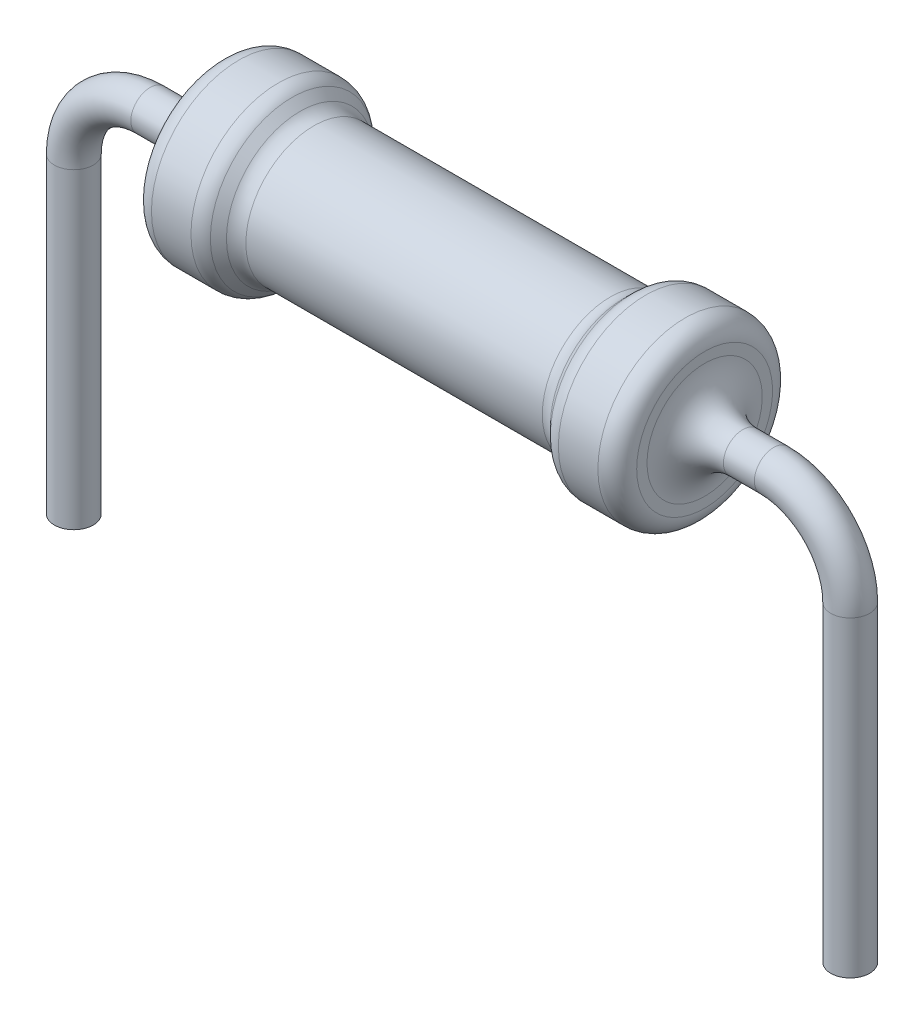
ISO-10303-21;
HEADER;
FILE_DESCRIPTION(('STEP AP214'),'2;1');
FILE_NAME('part.step','',(''),(''),'','','');
FILE_SCHEMA(('AUTOMOTIVE_DESIGN { 1 0 10303 214 1 1 1 1 }'));
ENDSEC;
DATA;
#1=APPLICATION_CONTEXT('core data for automotive mechanical design processes');
#2=APPLICATION_PROTOCOL_DEFINITION('international standard','automotive_design',2000,#1);
#3=PRODUCT_CONTEXT('',#1,'mechanical');
#4=PRODUCT('Part','Part','',(#3));
#5=PRODUCT_RELATED_PRODUCT_CATEGORY('part','',(#4));
#6=PRODUCT_DEFINITION_FORMATION('','',#4);
#7=PRODUCT_DEFINITION_CONTEXT('part definition',#1,'design');
#8=PRODUCT_DEFINITION('design','',#6,#7);
#9=PRODUCT_DEFINITION_SHAPE('','',#8);
#10=(LENGTH_UNIT() NAMED_UNIT(*) SI_UNIT(.MILLI.,.METRE.));
#11=(NAMED_UNIT(*) PLANE_ANGLE_UNIT() SI_UNIT($,.RADIAN.));
#12=(NAMED_UNIT(*) SI_UNIT($,.STERADIAN.) SOLID_ANGLE_UNIT());
#13=UNCERTAINTY_MEASURE_WITH_UNIT(LENGTH_MEASURE(1.E-05),#10,'distance_accuracy_value','');
#14=(GEOMETRIC_REPRESENTATION_CONTEXT(3) GLOBAL_UNCERTAINTY_ASSIGNED_CONTEXT((#13)) GLOBAL_UNIT_ASSIGNED_CONTEXT((#10,
#11,#12)) REPRESENTATION_CONTEXT('',''));
#15=CARTESIAN_POINT('',(0.,0.,0.));
#16=DIRECTION('',(0.,0.,1.));
#17=DIRECTION('',(1.,0.,0.));
#18=AXIS2_PLACEMENT_3D('',#15,#16,#17);
#19=CARTESIAN_POINT('',(3.175,0.889,0.));
#20=DIRECTION('',(-1.,0.,0.));
#21=DIRECTION('',(0.,0.,1.));
#22=AXIS2_PLACEMENT_3D('',#19,#20,#21);
#23=PLANE('',#22);
#24=CARTESIAN_POINT('',(3.175,0.,0.));
#25=DIRECTION('',(-1.,0.,0.));
#26=DIRECTION('',(0.,0.,1.));
#27=AXIS2_PLACEMENT_3D('',#24,#25,#26);
#28=CIRCLE('',#27,0.754);
#29=CARTESIAN_POINT('',(3.175,0.,0.754));
#30=VERTEX_POINT('',#29);
#31=EDGE_CURVE('E42',#30,#30,#28,.T.);
#32=ORIENTED_EDGE('',*,*,#31,.T.);
#33=EDGE_LOOP('',(#32));
#34=FACE_BOUND('',#33,.T.);
#35=CARTESIAN_POINT('',(3.175,0.,0.));
#36=DIRECTION('',(-1.,0.,0.));
#37=DIRECTION('',(0.,0.,1.));
#38=AXIS2_PLACEMENT_3D('',#35,#36,#37);
#39=CIRCLE('',#38,0.889);
#40=CARTESIAN_POINT('',(3.175,0.,0.889));
#41=VERTEX_POINT('',#40);
#42=EDGE_CURVE('E84',#41,#41,#39,.T.);
#43=ORIENTED_EDGE('',*,*,#42,.F.);
#44=EDGE_LOOP('',(#43));
#45=FACE_BOUND('',#44,.T.);
#46=ADVANCED_FACE('F31',(#34,#45),#23,.F.);
#47=CARTESIAN_POINT('',(-3.175,0.889,0.));
#48=DIRECTION('',(1.,0.,0.));
#49=DIRECTION('',(0.,0.,-1.));
#50=AXIS2_PLACEMENT_3D('',#47,#48,#49);
#51=PLANE('',#50);
#52=CARTESIAN_POINT('',(-3.175,0.,0.));
#53=DIRECTION('',(1.,0.,0.));
#54=DIRECTION('',(0.,0.,-1.));
#55=AXIS2_PLACEMENT_3D('',#52,#53,#54);
#56=CIRCLE('',#55,0.754);
#57=CARTESIAN_POINT('',(-3.175,0.,-0.754));
#58=VERTEX_POINT('',#57);
#59=EDGE_CURVE('E38',#58,#58,#56,.T.);
#60=ORIENTED_EDGE('',*,*,#59,.T.);
#61=EDGE_LOOP('',(#60));
#62=FACE_BOUND('',#61,.T.);
#63=CARTESIAN_POINT('',(-3.175,0.,0.));
#64=DIRECTION('',(-1.,0.,0.));
#65=DIRECTION('',(0.,0.,1.));
#66=AXIS2_PLACEMENT_3D('',#63,#64,#65);
#67=CIRCLE('',#66,0.889);
#68=CARTESIAN_POINT('',(-3.175,0.,0.889));
#69=VERTEX_POINT('',#68);
#70=EDGE_CURVE('E51',#69,#69,#67,.T.);
#71=ORIENTED_EDGE('',*,*,#70,.T.);
#72=EDGE_LOOP('',(#71));
#73=FACE_BOUND('',#72,.T.);
#74=ADVANCED_FACE('F130',(#62,#73),#51,.F.);
#75=CARTESIAN_POINT('',(-2.921,0.,0.));
#76=DIRECTION('',(-1.,0.,0.));
#77=DIRECTION('',(0.,0.,1.));
#78=AXIS2_PLACEMENT_3D('',#75,#76,#77);
#79=TOROIDAL_SURFACE('',#78,0.889,0.254);
#80=ORIENTED_EDGE('',*,*,#70,.F.);
#81=EDGE_LOOP('',(#80));
#82=FACE_BOUND('',#81,.T.);
#83=CARTESIAN_POINT('',(-2.921,0.,0.));
#84=DIRECTION('',(-1.,0.,0.));
#85=DIRECTION('',(0.,0.,1.));
#86=AXIS2_PLACEMENT_3D('',#83,#84,#85);
#87=CIRCLE('',#86,1.143);
#88=CARTESIAN_POINT('',(-2.921,0.,1.143));
#89=VERTEX_POINT('',#88);
#90=EDGE_CURVE('E54',#89,#89,#87,.T.);
#91=ORIENTED_EDGE('',*,*,#90,.T.);
#92=EDGE_LOOP('',(#91));
#93=FACE_BOUND('',#92,.T.);
#94=ADVANCED_FACE('F136',(#82,#93),#79,.T.);
#95=CARTESIAN_POINT('',(-13.0515359284181,0.,0.));
#96=DIRECTION('',(-1.,0.,0.));
#97=DIRECTION('',(0.,0.,1.));
#98=AXIS2_PLACEMENT_3D('',#95,#96,#97);
#99=CYLINDRICAL_SURFACE('',#98,1.143);
#100=ORIENTED_EDGE('',*,*,#90,.F.);
#101=EDGE_LOOP('',(#100));
#102=FACE_BOUND('',#101,.T.);
#103=CARTESIAN_POINT('',(-2.40403985017584,0.,0.));
#104=DIRECTION('',(-1.,0.,0.));
#105=DIRECTION('',(0.,0.,1.));
#106=AXIS2_PLACEMENT_3D('',#103,#104,#105);
#107=CIRCLE('',#106,1.143);
#108=CARTESIAN_POINT('',(-2.40403985017584,0.,1.143));
#109=VERTEX_POINT('',#108);
#110=EDGE_CURVE('E57',#109,#109,#107,.T.);
#111=ORIENTED_EDGE('',*,*,#110,.T.);
#112=EDGE_LOOP('',(#111));
#113=FACE_BOUND('',#112,.T.);
#114=ADVANCED_FACE('F179',(#102,#113),#99,.T.);
#115=CARTESIAN_POINT('',(-2.40403985017584,0.,0.));
#116=DIRECTION('',(-1.,0.,0.));
#117=DIRECTION('',(0.,0.,1.));
#118=AXIS2_PLACEMENT_3D('',#115,#116,#117);
#119=TOROIDAL_SURFACE('',#118,0.889,0.254000000000001);
#120=ORIENTED_EDGE('',*,*,#110,.F.);
#121=EDGE_LOOP('',(#120));
#122=FACE_BOUND('',#121,.T.);
#123=CARTESIAN_POINT('',(-2.22443472775445,0.,0.));
#124=DIRECTION('',(-1.,0.,0.));
#125=DIRECTION('',(0.,0.,1.));
#126=AXIS2_PLACEMENT_3D('',#123,#124,#125);
#127=CIRCLE('',#126,1.06860512242138);
#128=CARTESIAN_POINT('',(-2.22443472775445,0.,1.06860512242138));
#129=VERTEX_POINT('',#128);
#130=EDGE_CURVE('E60',#129,#129,#127,.T.);
#131=ORIENTED_EDGE('',*,*,#130,.T.);
#132=EDGE_LOOP('',(#131));
#133=FACE_BOUND('',#132,.T.);
#134=ADVANCED_FACE('F175',(#122,#133),#119,.T.);
#135=CARTESIAN_POINT('',(-2.11922448291169,0.,0.));
#136=DIRECTION('',(-1.,0.,0.));
#137=DIRECTION('',(0.,0.,1.));
#138=AXIS2_PLACEMENT_3D('',#135,#136,#137);
#139=CONICAL_SURFACE('',#138,0.963394877578619,0.785398163397457);
#140=ORIENTED_EDGE('',*,*,#130,.F.);
#141=EDGE_LOOP('',(#140));
#142=FACE_BOUND('',#141,.T.);
#143=CARTESIAN_POINT('',(-2.11922448291169,0.,0.));
#144=DIRECTION('',(-1.,0.,0.));
#145=DIRECTION('',(0.,0.,1.));
#146=AXIS2_PLACEMENT_3D('',#143,#144,#145);
#147=CIRCLE('',#146,0.963394877578619);
#148=CARTESIAN_POINT('',(-2.11922448291169,0.,0.963394877578619));
#149=VERTEX_POINT('',#148);
#150=EDGE_CURVE('E63',#149,#149,#147,.T.);
#151=ORIENTED_EDGE('',*,*,#150,.T.);
#152=EDGE_LOOP('',(#151));
#153=FACE_BOUND('',#152,.T.);
#154=ADVANCED_FACE('F171',(#142,#153),#139,.T.);
#155=CARTESIAN_POINT('',(-1.93961936049031,0.,0.));
#156=DIRECTION('',(-1.,0.,0.));
#157=DIRECTION('',(0.,0.,1.));
#158=AXIS2_PLACEMENT_3D('',#155,#156,#157);
#159=TOROIDAL_SURFACE('',#158,1.143,0.253999999999999);
#160=ORIENTED_EDGE('',*,*,#150,.F.);
#161=EDGE_LOOP('',(#160));
#162=FACE_BOUND('',#161,.T.);
#163=CARTESIAN_POINT('',(-1.9396193604903,0.,0.));
#164=DIRECTION('',(-1.,0.,0.));
#165=DIRECTION('',(0.,0.,1.));
#166=AXIS2_PLACEMENT_3D('',#163,#164,#165);
#167=CIRCLE('',#166,0.889);
#168=CARTESIAN_POINT('',(-1.9396193604903,0.,0.889));
#169=VERTEX_POINT('',#168);
#170=EDGE_CURVE('E66',#169,#169,#167,.T.);
#171=ORIENTED_EDGE('',*,*,#170,.T.);
#172=EDGE_LOOP('',(#171));
#173=FACE_BOUND('',#172,.T.);
#174=ADVANCED_FACE('F167',(#162,#173),#159,.F.);
#175=CARTESIAN_POINT('',(-13.0515359284181,0.,0.));
#176=DIRECTION('',(-1.,0.,0.));
#177=DIRECTION('',(0.,0.,1.));
#178=AXIS2_PLACEMENT_3D('',#175,#176,#177);
#179=CYLINDRICAL_SURFACE('',#178,0.889);
#180=ORIENTED_EDGE('',*,*,#170,.F.);
#181=EDGE_LOOP('',(#180));
#182=FACE_BOUND('',#181,.T.);
#183=CARTESIAN_POINT('',(1.93961936049031,0.,0.));
#184=DIRECTION('',(-1.,0.,0.));
#185=DIRECTION('',(0.,0.,1.));
#186=AXIS2_PLACEMENT_3D('',#183,#184,#185);
#187=CIRCLE('',#186,0.889);
#188=CARTESIAN_POINT('',(1.93961936049031,0.,0.889));
#189=VERTEX_POINT('',#188);
#190=EDGE_CURVE('E69',#189,#189,#187,.T.);
#191=ORIENTED_EDGE('',*,*,#190,.T.);
#192=EDGE_LOOP('',(#191));
#193=FACE_BOUND('',#192,.T.);
#194=ADVANCED_FACE('F163',(#182,#193),#179,.T.);
#195=CARTESIAN_POINT('',(1.93961936049031,0.,0.));
#196=DIRECTION('',(-1.,0.,0.));
#197=DIRECTION('',(0.,0.,1.));
#198=AXIS2_PLACEMENT_3D('',#195,#196,#197);
#199=TOROIDAL_SURFACE('',#198,1.143,0.254);
#200=ORIENTED_EDGE('',*,*,#190,.F.);
#201=EDGE_LOOP('',(#200));
#202=FACE_BOUND('',#201,.T.);
#203=CARTESIAN_POINT('',(2.11922448291169,0.,0.));
#204=DIRECTION('',(-1.,0.,0.));
#205=DIRECTION('',(0.,0.,1.));
#206=AXIS2_PLACEMENT_3D('',#203,#204,#205);
#207=CIRCLE('',#206,0.963394877578619);
#208=CARTESIAN_POINT('',(2.11922448291169,0.,0.963394877578619));
#209=VERTEX_POINT('',#208);
#210=EDGE_CURVE('E72',#209,#209,#207,.T.);
#211=ORIENTED_EDGE('',*,*,#210,.T.);
#212=EDGE_LOOP('',(#211));
#213=FACE_BOUND('',#212,.T.);
#214=ADVANCED_FACE('F159',(#202,#213),#199,.F.);
#215=CARTESIAN_POINT('',(2.22443472775446,0.,0.));
#216=DIRECTION('',(1.,0.,0.));
#217=DIRECTION('',(0.,0.,-1.));
#218=AXIS2_PLACEMENT_3D('',#215,#216,#217);
#219=CONICAL_SURFACE('',#218,1.06860512242138,0.785398163397446);
#220=ORIENTED_EDGE('',*,*,#210,.F.);
#221=EDGE_LOOP('',(#220));
#222=FACE_BOUND('',#221,.T.);
#223=CARTESIAN_POINT('',(2.22443472775446,0.,0.));
#224=DIRECTION('',(-1.,0.,0.));
#225=DIRECTION('',(0.,0.,1.));
#226=AXIS2_PLACEMENT_3D('',#223,#224,#225);
#227=CIRCLE('',#226,1.06860512242138);
#228=CARTESIAN_POINT('',(2.22443472775446,0.,1.06860512242138));
#229=VERTEX_POINT('',#228);
#230=EDGE_CURVE('E75',#229,#229,#227,.T.);
#231=ORIENTED_EDGE('',*,*,#230,.T.);
#232=EDGE_LOOP('',(#231));
#233=FACE_BOUND('',#232,.T.);
#234=ADVANCED_FACE('F155',(#222,#233),#219,.T.);
#235=CARTESIAN_POINT('',(2.40403985017584,0.,0.));
#236=DIRECTION('',(-1.,0.,0.));
#237=DIRECTION('',(0.,0.,1.));
#238=AXIS2_PLACEMENT_3D('',#235,#236,#237);
#239=TOROIDAL_SURFACE('',#238,0.889,0.254);
#240=ORIENTED_EDGE('',*,*,#230,.F.);
#241=EDGE_LOOP('',(#240));
#242=FACE_BOUND('',#241,.T.);
#243=CARTESIAN_POINT('',(2.40403985017584,0.,0.));
#244=DIRECTION('',(-1.,0.,0.));
#245=DIRECTION('',(0.,0.,1.));
#246=AXIS2_PLACEMENT_3D('',#243,#244,#245);
#247=CIRCLE('',#246,1.143);
#248=CARTESIAN_POINT('',(2.40403985017584,0.,1.143));
#249=VERTEX_POINT('',#248);
#250=EDGE_CURVE('E78',#249,#249,#247,.T.);
#251=ORIENTED_EDGE('',*,*,#250,.T.);
#252=EDGE_LOOP('',(#251));
#253=FACE_BOUND('',#252,.T.);
#254=ADVANCED_FACE('F151',(#242,#253),#239,.T.);
#255=CARTESIAN_POINT('',(-13.0515359284181,0.,0.));
#256=DIRECTION('',(-1.,0.,0.));
#257=DIRECTION('',(0.,0.,1.));
#258=AXIS2_PLACEMENT_3D('',#255,#256,#257);
#259=CYLINDRICAL_SURFACE('',#258,1.143);
#260=ORIENTED_EDGE('',*,*,#250,.F.);
#261=EDGE_LOOP('',(#260));
#262=FACE_BOUND('',#261,.T.);
#263=CARTESIAN_POINT('',(2.921,0.,0.));
#264=DIRECTION('',(-1.,0.,0.));
#265=DIRECTION('',(0.,0.,1.));
#266=AXIS2_PLACEMENT_3D('',#263,#264,#265);
#267=CIRCLE('',#266,1.143);
#268=CARTESIAN_POINT('',(2.921,0.,1.143));
#269=VERTEX_POINT('',#268);
#270=EDGE_CURVE('E81',#269,#269,#267,.T.);
#271=ORIENTED_EDGE('',*,*,#270,.T.);
#272=EDGE_LOOP('',(#271));
#273=FACE_BOUND('',#272,.T.);
#274=ADVANCED_FACE('F147',(#262,#273),#259,.T.);
#275=CARTESIAN_POINT('',(2.921,0.,0.));
#276=DIRECTION('',(-1.,0.,0.));
#277=DIRECTION('',(0.,0.,1.));
#278=AXIS2_PLACEMENT_3D('',#275,#276,#277);
#279=TOROIDAL_SURFACE('',#278,0.889,0.254);
#280=ORIENTED_EDGE('',*,*,#270,.F.);
#281=EDGE_LOOP('',(#280));
#282=FACE_BOUND('',#281,.T.);
#283=ORIENTED_EDGE('',*,*,#42,.T.);
#284=EDGE_LOOP('',(#283));
#285=FACE_BOUND('',#284,.T.);
#286=ADVANCED_FACE('F143',(#282,#285),#279,.T.);
#287=CARTESIAN_POINT('',(4.07999999999999,0.,0.));
#288=DIRECTION('',(-1.,0.,0.));
#289=DIRECTION('',(0.,-1.,0.));
#290=AXIS2_PLACEMENT_3D('',#287,#288,#289);
#291=CYLINDRICAL_SURFACE('',#290,0.254);
#292=CARTESIAN_POINT('',(3.675,0.,0.));
#293=DIRECTION('',(-1.,0.,0.));
#294=DIRECTION('',(0.,0.,1.));
#295=AXIS2_PLACEMENT_3D('',#292,#293,#294);
#296=CIRCLE('',#295,0.254);
#297=CARTESIAN_POINT('',(3.675,0.,0.254));
#298=VERTEX_POINT('',#297);
#299=EDGE_CURVE('E46',#298,#298,#296,.F.);
#300=ORIENTED_EDGE('',*,*,#299,.T.);
#301=EDGE_LOOP('',(#300));
#302=FACE_BOUND('',#301,.T.);
#303=CARTESIAN_POINT('',(4.07999999999999,0.,0.));
#304=DIRECTION('',(1.,0.,0.));
#305=DIRECTION('',(0.,0.,-1.));
#306=AXIS2_PLACEMENT_3D('',#303,#304,#305);
#307=CIRCLE('',#306,0.254);
#308=CARTESIAN_POINT('',(4.07999999999999,0.253999999999999,0.));
#309=VERTEX_POINT('',#308);
#310=EDGE_CURVE('E93',#309,#309,#307,.T.);
#311=ORIENTED_EDGE('',*,*,#310,.F.);
#312=EDGE_LOOP('',(#311));
#313=FACE_BOUND('',#312,.T.);
#314=ADVANCED_FACE('F146',(#302,#313),#291,.T.);
#315=CARTESIAN_POINT('',(5.08000000000001,-1.00000000000001,0.));
#316=DIRECTION('',(0.,-1.,0.));
#317=DIRECTION('',(1.,0.,0.));
#318=AXIS2_PLACEMENT_3D('',#315,#316,#317);
#319=CYLINDRICAL_SURFACE('',#318,0.254);
#320=CARTESIAN_POINT('',(5.08000000000001,-1.00000000000001,0.));
#321=DIRECTION('',(0.,-1.,0.));
#322=DIRECTION('',(0.,0.,-1.));
#323=AXIS2_PLACEMENT_3D('',#320,#321,#322);
#324=CIRCLE('',#323,0.254);
#325=CARTESIAN_POINT('',(5.334,-1.00000000000001,0.));
#326=VERTEX_POINT('',#325);
#327=EDGE_CURVE('E90',#326,#326,#324,.T.);
#328=ORIENTED_EDGE('',*,*,#327,.T.);
#329=EDGE_LOOP('',(#328));
#330=FACE_BOUND('',#329,.T.);
#331=CARTESIAN_POINT('',(5.08000000000003,-5.08,0.));
#332=DIRECTION('',(0.,-1.,0.));
#333=DIRECTION('',(0.,0.,-1.));
#334=AXIS2_PLACEMENT_3D('',#331,#332,#333);
#335=CIRCLE('',#334,0.254);
#336=CARTESIAN_POINT('',(5.08000000000003,-5.08,-0.254));
#337=VERTEX_POINT('',#336);
#338=EDGE_CURVE('E87',#337,#337,#335,.T.);
#339=ORIENTED_EDGE('',*,*,#338,.F.);
#340=EDGE_LOOP('',(#339));
#341=FACE_BOUND('',#340,.T.);
#342=ADVANCED_FACE('F141',(#330,#341),#319,.T.);
#343=CARTESIAN_POINT('',(4.08000000000001,-1.,0.));
#344=DIRECTION('',(0.,0.,-1.));
#345=DIRECTION('',(-1.,0.,0.));
#346=AXIS2_PLACEMENT_3D('',#343,#344,#345);
#347=TOROIDAL_SURFACE('',#346,1.,0.254);
#348=CARTESIAN_POINT('',(4.08000000000001,-1.,0.));
#349=DIRECTION('',(0.,0.,-1.));
#350=DIRECTION('',(-1.,0.,0.));
#351=AXIS2_PLACEMENT_3D('',#348,#349,#350);
#352=CIRCLE('',#351,1.254);
#353=EDGE_CURVE('',#309,#326,#352,.T.);
#354=ORIENTED_EDGE('',*,*,#310,.T.);
#355=ORIENTED_EDGE('',*,*,#327,.F.);
#356=ORIENTED_EDGE('',*,*,#353,.T.);
#357=ORIENTED_EDGE('',*,*,#353,.F.);
#358=EDGE_LOOP('',(#354,#356,#355,#357));
#359=FACE_BOUND('',#358,.T.);
#360=ADVANCED_FACE('F273',(#359),#347,.T.);
#361=CARTESIAN_POINT('',(5.08000000000003,-5.08,0.));
#362=DIRECTION('',(0.,-1.,0.));
#363=DIRECTION('',(0.,0.,-1.));
#364=AXIS2_PLACEMENT_3D('',#361,#362,#363);
#365=PLANE('',#364);
#366=ORIENTED_EDGE('',*,*,#338,.T.);
#367=EDGE_LOOP('',(#366));
#368=FACE_BOUND('',#367,.T.);
#369=ADVANCED_FACE('F280',(#368),#365,.T.);
#370=CARTESIAN_POINT('',(-4.07999999999999,0.,0.));
#371=DIRECTION('',(1.,0.,0.));
#372=DIRECTION('',(0.,1.,0.));
#373=AXIS2_PLACEMENT_3D('',#370,#371,#372);
#374=CYLINDRICAL_SURFACE('',#373,0.254);
#375=CARTESIAN_POINT('',(-3.675,0.,0.));
#376=DIRECTION('',(1.,0.,0.));
#377=DIRECTION('',(0.,0.,-1.));
#378=AXIS2_PLACEMENT_3D('',#375,#376,#377);
#379=CIRCLE('',#378,0.254);
#380=CARTESIAN_POINT('',(-3.675,0.,-0.254));
#381=VERTEX_POINT('',#380);
#382=EDGE_CURVE('E10',#381,#381,#379,.F.);
#383=ORIENTED_EDGE('',*,*,#382,.T.);
#384=EDGE_LOOP('',(#383));
#385=FACE_BOUND('',#384,.T.);
#386=CARTESIAN_POINT('',(-4.07999999999999,0.,0.));
#387=DIRECTION('',(1.,0.,0.));
#388=DIRECTION('',(0.,0.,-1.));
#389=AXIS2_PLACEMENT_3D('',#386,#387,#388);
#390=CIRCLE('',#389,0.254);
#391=CARTESIAN_POINT('',(-4.07999999999999,0.253999999999999,0.));
#392=VERTEX_POINT('',#391);
#393=EDGE_CURVE('E102',#392,#392,#390,.T.);
#394=ORIENTED_EDGE('',*,*,#393,.T.);
#395=EDGE_LOOP('',(#394));
#396=FACE_BOUND('',#395,.T.);
#397=ADVANCED_FACE('F106',(#385,#396),#374,.T.);
#398=CARTESIAN_POINT('',(-5.08000000000001,-1.00000000000001,0.));
#399=DIRECTION('',(0.,-1.,0.));
#400=DIRECTION('',(1.,0.,0.));
#401=AXIS2_PLACEMENT_3D('',#398,#399,#400);
#402=CYLINDRICAL_SURFACE('',#401,0.254);
#403=CARTESIAN_POINT('',(-5.08000000000001,-1.00000000000001,0.));
#404=DIRECTION('',(0.,1.,0.));
#405=DIRECTION('',(0.,0.,-1.));
#406=AXIS2_PLACEMENT_3D('',#403,#404,#405);
#407=CIRCLE('',#406,0.254);
#408=CARTESIAN_POINT('',(-5.334,-1.00000000000001,0.));
#409=VERTEX_POINT('',#408);
#410=EDGE_CURVE('E99',#409,#409,#407,.T.);
#411=ORIENTED_EDGE('',*,*,#410,.F.);
#412=EDGE_LOOP('',(#411));
#413=FACE_BOUND('',#412,.T.);
#414=CARTESIAN_POINT('',(-5.08000000000003,-5.08,0.));
#415=DIRECTION('',(0.,1.,0.));
#416=DIRECTION('',(0.,0.,-1.));
#417=AXIS2_PLACEMENT_3D('',#414,#415,#416);
#418=CIRCLE('',#417,0.254);
#419=CARTESIAN_POINT('',(-5.08000000000003,-5.08,-0.254));
#420=VERTEX_POINT('',#419);
#421=EDGE_CURVE('E96',#420,#420,#418,.T.);
#422=ORIENTED_EDGE('',*,*,#421,.T.);
#423=EDGE_LOOP('',(#422));
#424=FACE_BOUND('',#423,.T.);
#425=ADVANCED_FACE('F112',(#413,#424),#402,.T.);
#426=CARTESIAN_POINT('',(-4.08000000000001,-1.,0.));
#427=DIRECTION('',(0.,0.,1.));
#428=DIRECTION('',(1.,0.,0.));
#429=AXIS2_PLACEMENT_3D('',#426,#427,#428);
#430=TOROIDAL_SURFACE('',#429,1.,0.254);
#431=CARTESIAN_POINT('',(-4.08000000000001,-1.,0.));
#432=DIRECTION('',(0.,0.,1.));
#433=DIRECTION('',(1.,0.,0.));
#434=AXIS2_PLACEMENT_3D('',#431,#432,#433);
#435=CIRCLE('',#434,1.254);
#436=EDGE_CURVE('',#392,#409,#435,.T.);
#437=ORIENTED_EDGE('',*,*,#393,.F.);
#438=ORIENTED_EDGE('',*,*,#410,.T.);
#439=ORIENTED_EDGE('',*,*,#436,.T.);
#440=ORIENTED_EDGE('',*,*,#436,.F.);
#441=EDGE_LOOP('',(#437,#439,#438,#440));
#442=FACE_BOUND('',#441,.T.);
#443=ADVANCED_FACE('F108',(#442),#430,.T.);
#444=CARTESIAN_POINT('',(-5.08000000000003,-5.08,0.));
#445=DIRECTION('',(0.,-1.,0.));
#446=DIRECTION('',(0.,0.,-1.));
#447=AXIS2_PLACEMENT_3D('',#444,#445,#446);
#448=PLANE('',#447);
#449=ORIENTED_EDGE('',*,*,#421,.F.);
#450=EDGE_LOOP('',(#449));
#451=FACE_BOUND('',#450,.T.);
#452=ADVANCED_FACE('F111',(#451),#448,.T.);
#453=CARTESIAN_POINT('',(3.675,0.,0.));
#454=DIRECTION('',(-1.,0.,0.));
#455=DIRECTION('',(0.,0.,1.));
#456=AXIS2_PLACEMENT_3D('',#453,#454,#455);
#457=TOROIDAL_SURFACE('',#456,0.754,0.5);
#458=ORIENTED_EDGE('',*,*,#31,.F.);
#459=EDGE_LOOP('',(#458));
#460=FACE_BOUND('',#459,.T.);
#461=ORIENTED_EDGE('',*,*,#299,.F.);
#462=EDGE_LOOP('',(#461));
#463=FACE_BOUND('',#462,.T.);
#464=ADVANCED_FACE('F122',(#460,#463),#457,.F.);
#465=CARTESIAN_POINT('',(-3.675,0.,0.));
#466=DIRECTION('',(1.,0.,0.));
#467=DIRECTION('',(0.,0.,-1.));
#468=AXIS2_PLACEMENT_3D('',#465,#466,#467);
#469=TOROIDAL_SURFACE('',#468,0.754,0.5);
#470=ORIENTED_EDGE('',*,*,#382,.F.);
#471=EDGE_LOOP('',(#470));
#472=FACE_BOUND('',#471,.T.);
#473=ORIENTED_EDGE('',*,*,#59,.F.);
#474=EDGE_LOOP('',(#473));
#475=FACE_BOUND('',#474,.T.);
#476=ADVANCED_FACE('F33',(#472,#475),#469,.F.);
#477=CLOSED_SHELL('',(#46,#74,#94,#114,#134,#154,#174,#194,#214,#234,#254,#274,#286,#314,#342,
#360,#369,#397,#425,#443,#452,#464,#476));
#478=MANIFOLD_SOLID_BREP('B2',#477);
#479=ADVANCED_BREP_SHAPE_REPRESENTATION('',(#18,#478),#14);
#480=SHAPE_DEFINITION_REPRESENTATION(#9,#479);
ENDSEC;
END-ISO-10303-21;
